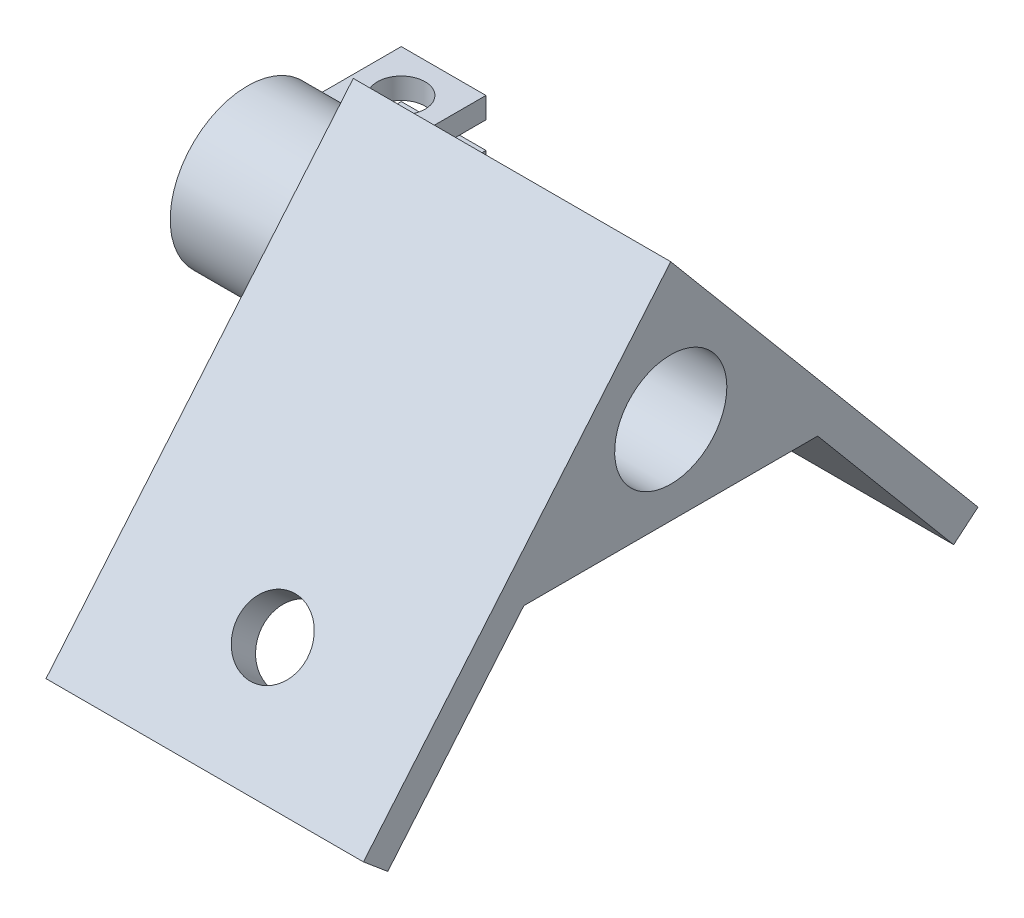
ISO-10303-21;
HEADER;
FILE_DESCRIPTION(('STEP AP214'),'2;1');
FILE_NAME('part.step','',(''),(''),'','','');
FILE_SCHEMA(('AUTOMOTIVE_DESIGN { 1 0 10303 214 1 1 1 1 }'));
ENDSEC;
DATA;
#1=APPLICATION_CONTEXT('core data for automotive mechanical design processes');
#2=APPLICATION_PROTOCOL_DEFINITION('international standard','automotive_design',2000,#1);
#3=PRODUCT_CONTEXT('',#1,'mechanical');
#4=PRODUCT('Part','Part','',(#3));
#5=PRODUCT_RELATED_PRODUCT_CATEGORY('part','',(#4));
#6=PRODUCT_DEFINITION_FORMATION('','',#4);
#7=PRODUCT_DEFINITION_CONTEXT('part definition',#1,'design');
#8=PRODUCT_DEFINITION('design','',#6,#7);
#9=PRODUCT_DEFINITION_SHAPE('','',#8);
#10=(LENGTH_UNIT() NAMED_UNIT(*) SI_UNIT(.MILLI.,.METRE.));
#11=(NAMED_UNIT(*) PLANE_ANGLE_UNIT() SI_UNIT($,.RADIAN.));
#12=(NAMED_UNIT(*) SI_UNIT($,.STERADIAN.) SOLID_ANGLE_UNIT());
#13=UNCERTAINTY_MEASURE_WITH_UNIT(LENGTH_MEASURE(1.E-05),#10,'distance_accuracy_value','');
#14=(GEOMETRIC_REPRESENTATION_CONTEXT(3) GLOBAL_UNCERTAINTY_ASSIGNED_CONTEXT((#13)) GLOBAL_UNIT_ASSIGNED_CONTEXT((#10,
#11,#12)) REPRESENTATION_CONTEXT('',''));
#15=CARTESIAN_POINT('',(0.,0.,0.));
#16=DIRECTION('',(0.,0.,1.));
#17=DIRECTION('',(1.,0.,0.));
#18=AXIS2_PLACEMENT_3D('',#15,#16,#17);
#19=CARTESIAN_POINT('',(15.,0.,0.));
#20=DIRECTION('',(-1.,0.,0.));
#21=DIRECTION('',(0.,0.,1.));
#22=AXIS2_PLACEMENT_3D('',#19,#20,#21);
#23=PLANE('',#22);
#24=DIRECTION('',(0.,0.766044443118977,0.64278760968654));
#25=VECTOR('',#24,1.);
#26=CARTESIAN_POINT('',(15.,12.9125077629414,0.));
#27=LINE('',#26,#25);
#28=CARTESIAN_POINT('',(15.,-21.6925260333199,-29.0370710953203));
#29=VERTEX_POINT('',#28);
#30=CARTESIAN_POINT('',(15.,12.9125077629414,0.));
#31=VERTEX_POINT('',#30);
#32=EDGE_CURVE('E253',#29,#31,#27,.T.);
#33=ORIENTED_EDGE('',*,*,#32,.T.);
#34=DIRECTION('',(0.,-0.766044443118977,0.642787609686541));
#35=VECTOR('',#34,1.);
#36=CARTESIAN_POINT('',(15.,12.9125077629414,0.));
#37=LINE('',#36,#35);
#38=CARTESIAN_POINT('',(15.,-21.6925260333199,29.0370710953203));
#39=VERTEX_POINT('',#38);
#40=EDGE_CURVE('E256',#31,#39,#37,.T.);
#41=ORIENTED_EDGE('',*,*,#40,.T.);
#42=DIRECTION('',(0.,-0.642787609686539,-0.766044443118978));
#43=VECTOR('',#42,1.);
#44=CARTESIAN_POINT('',(15.,-21.6925260333199,29.0370710953203));
#45=LINE('',#44,#43);
#46=CARTESIAN_POINT('',(15.,-23.6208888623795,26.7389377659634));
#47=VERTEX_POINT('',#46);
#48=EDGE_CURVE('E259',#39,#47,#45,.T.);
#49=ORIENTED_EDGE('',*,*,#48,.T.);
#50=DIRECTION('',(0.,0.766044443118977,-0.642787609686541));
#51=VECTOR('',#50,1.);
#52=CARTESIAN_POINT('',(15.,-23.6208888623795,26.7389377659634));
#53=LINE('',#52,#51);
#54=CARTESIAN_POINT('',(15.,-8.3,13.8831855722325));
#55=VERTEX_POINT('',#54);
#56=EDGE_CURVE('E261',#47,#55,#53,.T.);
#57=ORIENTED_EDGE('',*,*,#56,.T.);
#58=DIRECTION('',(0.,0.,-1.));
#59=VECTOR('',#58,1.);
#60=CARTESIAN_POINT('',(15.,-8.3,13.8831855722325));
#61=LINE('',#60,#59);
#62=CARTESIAN_POINT('',(15.,-8.3,-13.8831855722325));
#63=VERTEX_POINT('',#62);
#64=EDGE_CURVE('E263',#55,#63,#61,.T.);
#65=ORIENTED_EDGE('',*,*,#64,.T.);
#66=DIRECTION('',(0.,-0.766044443118977,-0.64278760968654));
#67=VECTOR('',#66,1.);
#68=CARTESIAN_POINT('',(15.,-23.6208888623795,-26.7389377659633));
#69=LINE('',#68,#67);
#70=CARTESIAN_POINT('',(15.,-23.6208888623795,-26.7389377659633));
#71=VERTEX_POINT('',#70);
#72=EDGE_CURVE('E265',#63,#71,#69,.T.);
#73=ORIENTED_EDGE('',*,*,#72,.T.);
#74=DIRECTION('',(0.,0.642787609686539,-0.766044443118978));
#75=VECTOR('',#74,1.);
#76=CARTESIAN_POINT('',(15.,-21.6925260333199,-29.0370710953203));
#77=LINE('',#76,#75);
#78=EDGE_CURVE('E267',#71,#29,#77,.T.);
#79=ORIENTED_EDGE('',*,*,#78,.T.);
#80=EDGE_LOOP('',(#33,#41,#49,#57,#65,#73,#79));
#81=FACE_BOUND('',#80,.T.);
#82=CARTESIAN_POINT('',(15.,0.,0.));
#83=DIRECTION('',(1.,0.,0.));
#84=DIRECTION('',(0.,0.,-1.));
#85=AXIS2_PLACEMENT_3D('',#82,#83,#84);
#86=CIRCLE('',#85,5.3);
#87=CARTESIAN_POINT('',(15.,0.,-5.3));
#88=VERTEX_POINT('',#87);
#89=EDGE_CURVE('E249',#88,#88,#86,.T.);
#90=ORIENTED_EDGE('',*,*,#89,.F.);
#91=EDGE_LOOP('',(#90));
#92=FACE_BOUND('',#91,.T.);
#93=ADVANCED_FACE('F35',(#81,#92),#23,.F.);
#94=CARTESIAN_POINT('',(-15.,0.,0.));
#95=DIRECTION('',(-1.,0.,0.));
#96=DIRECTION('',(0.,0.,1.));
#97=AXIS2_PLACEMENT_3D('',#94,#95,#96);
#98=PLANE('',#97);
#99=DIRECTION('',(0.,0.,1.));
#100=VECTOR('',#99,1.);
#101=CARTESIAN_POINT('',(-15.,1.25,-5.15048541401682));
#102=LINE('',#101,#100);
#103=CARTESIAN_POINT('',(-15.,1.25,-7.19218325684211));
#104=VERTEX_POINT('',#103);
#105=CARTESIAN_POINT('',(-15.,1.25,-5.15048541401682));
#106=VERTEX_POINT('',#105);
#107=EDGE_CURVE('E236',#104,#106,#102,.T.);
#108=ORIENTED_EDGE('',*,*,#107,.F.);
#109=CARTESIAN_POINT('',(-15.,0.,0.));
#110=DIRECTION('',(-1.,0.,0.));
#111=DIRECTION('',(0.,0.,1.));
#112=AXIS2_PLACEMENT_3D('',#109,#110,#111);
#113=CIRCLE('',#112,7.3);
#114=CARTESIAN_POINT('',(-15.,-1.25,-7.19218325684211));
#115=VERTEX_POINT('',#114);
#116=EDGE_CURVE('E224',#115,#104,#113,.T.);
#117=ORIENTED_EDGE('',*,*,#116,.F.);
#118=DIRECTION('',(0.,0.,-1.));
#119=VECTOR('',#118,1.);
#120=CARTESIAN_POINT('',(-15.,-1.25,-5.15048541401682));
#121=LINE('',#120,#119);
#122=CARTESIAN_POINT('',(-15.,-1.25,-5.15048541401682));
#123=VERTEX_POINT('',#122);
#124=EDGE_CURVE('E306',#123,#115,#121,.T.);
#125=ORIENTED_EDGE('',*,*,#124,.F.);
#126=CARTESIAN_POINT('',(-15.,0.,0.));
#127=DIRECTION('',(1.,0.,0.));
#128=DIRECTION('',(0.,0.,-1.));
#129=AXIS2_PLACEMENT_3D('',#126,#127,#128);
#130=CIRCLE('',#129,5.3);
#131=EDGE_CURVE('E172',#123,#106,#130,.T.);
#132=ORIENTED_EDGE('',*,*,#131,.T.);
#133=EDGE_LOOP('',(#108,#117,#125,#132));
#134=FACE_BOUND('',#133,.T.);
#135=DIRECTION('',(0.,0.766044443118977,0.64278760968654));
#136=VECTOR('',#135,1.);
#137=CARTESIAN_POINT('',(-15.,12.9125077629414,0.));
#138=LINE('',#137,#136);
#139=CARTESIAN_POINT('',(-15.,-21.6925260333199,-29.0370710953203));
#140=VERTEX_POINT('',#139);
#141=CARTESIAN_POINT('',(-15.,12.9125077629414,0.));
#142=VERTEX_POINT('',#141);
#143=EDGE_CURVE('E252',#140,#142,#138,.T.);
#144=ORIENTED_EDGE('',*,*,#143,.F.);
#145=DIRECTION('',(0.,0.642787609686539,-0.766044443118978));
#146=VECTOR('',#145,1.);
#147=CARTESIAN_POINT('',(-15.,-21.6925260333199,-29.0370710953203));
#148=LINE('',#147,#146);
#149=CARTESIAN_POINT('',(-15.,-23.6208888623795,-26.7389377659633));
#150=VERTEX_POINT('',#149);
#151=EDGE_CURVE('E257',#150,#140,#148,.T.);
#152=ORIENTED_EDGE('',*,*,#151,.F.);
#153=DIRECTION('',(0.,-0.766044443118977,-0.64278760968654));
#154=VECTOR('',#153,1.);
#155=CARTESIAN_POINT('',(-15.,-23.6208888623795,-26.7389377659633));
#156=LINE('',#155,#154);
#157=CARTESIAN_POINT('',(-15.,-8.3,-13.8831855722325));
#158=VERTEX_POINT('',#157);
#159=EDGE_CURVE('E280',#158,#150,#156,.T.);
#160=ORIENTED_EDGE('',*,*,#159,.F.);
#161=DIRECTION('',(0.,0.,-1.));
#162=VECTOR('',#161,1.);
#163=CARTESIAN_POINT('',(-15.,-8.3,13.8831855722325));
#164=LINE('',#163,#162);
#165=CARTESIAN_POINT('',(-15.,-8.3,13.8831855722325));
#166=VERTEX_POINT('',#165);
#167=EDGE_CURVE('E278',#166,#158,#164,.T.);
#168=ORIENTED_EDGE('',*,*,#167,.F.);
#169=DIRECTION('',(0.,0.766044443118977,-0.642787609686541));
#170=VECTOR('',#169,1.);
#171=CARTESIAN_POINT('',(-15.,-23.6208888623795,26.7389377659634));
#172=LINE('',#171,#170);
#173=CARTESIAN_POINT('',(-15.,-23.6208888623795,26.7389377659634));
#174=VERTEX_POINT('',#173);
#175=EDGE_CURVE('E276',#174,#166,#172,.T.);
#176=ORIENTED_EDGE('',*,*,#175,.F.);
#177=DIRECTION('',(0.,-0.642787609686539,-0.766044443118978));
#178=VECTOR('',#177,1.);
#179=CARTESIAN_POINT('',(-15.,-21.6925260333199,29.0370710953203));
#180=LINE('',#179,#178);
#181=CARTESIAN_POINT('',(-15.,-21.6925260333199,29.0370710953203));
#182=VERTEX_POINT('',#181);
#183=EDGE_CURVE('E274',#182,#174,#180,.T.);
#184=ORIENTED_EDGE('',*,*,#183,.F.);
#185=DIRECTION('',(0.,-0.766044443118977,0.642787609686541));
#186=VECTOR('',#185,1.);
#187=CARTESIAN_POINT('',(-15.,12.9125077629414,0.));
#188=LINE('',#187,#186);
#189=EDGE_CURVE('E272',#142,#182,#188,.T.);
#190=ORIENTED_EDGE('',*,*,#189,.F.);
#191=EDGE_LOOP('',(#144,#152,#160,#168,#176,#184,#190));
#192=FACE_BOUND('',#191,.T.);
#193=ADVANCED_FACE('F377',(#134,#192),#98,.T.);
#194=CARTESIAN_POINT('',(15.,12.9125077629414,0.));
#195=DIRECTION('',(0.,-0.64278760968654,0.766044443118977));
#196=DIRECTION('',(0.,-0.766044443118977,-0.64278760968654));
#197=AXIS2_PLACEMENT_3D('',#194,#195,#196);
#198=PLANE('',#197);
#199=CARTESIAN_POINT('',(0.,-14.0320816021302,-22.6091949984549));
#200=DIRECTION('',(0.,-0.64278760968654,0.766044443118977));
#201=DIRECTION('',(0.,-0.766044443118977,-0.64278760968654));
#202=AXIS2_PLACEMENT_3D('',#199,#200,#201);
#203=CIRCLE('',#202,3.29999999999999);
#204=CARTESIAN_POINT('',(0.,-16.5600282644228,-24.7303941104204));
#205=VERTEX_POINT('',#204);
#206=EDGE_CURVE('E244',#205,#205,#203,.T.);
#207=ORIENTED_EDGE('',*,*,#206,.T.);
#208=EDGE_LOOP('',(#207));
#209=FACE_BOUND('',#208,.T.);
#210=ORIENTED_EDGE('',*,*,#143,.T.);
#211=DIRECTION('',(-1.,0.,0.));
#212=VECTOR('',#211,1.);
#213=CARTESIAN_POINT('',(15.,12.9125077629414,0.));
#214=LINE('',#213,#212);
#215=EDGE_CURVE('E11',#31,#142,#214,.T.);
#216=ORIENTED_EDGE('',*,*,#215,.F.);
#217=ORIENTED_EDGE('',*,*,#32,.F.);
#218=DIRECTION('',(-1.,0.,0.));
#219=VECTOR('',#218,1.);
#220=CARTESIAN_POINT('',(15.,-21.6925260333199,-29.0370710953203));
#221=LINE('',#220,#219);
#222=EDGE_CURVE('E269',#29,#140,#221,.T.);
#223=ORIENTED_EDGE('',*,*,#222,.T.);
#224=EDGE_LOOP('',(#210,#216,#217,#223));
#225=FACE_BOUND('',#224,.T.);
#226=ADVANCED_FACE('F37',(#209,#225),#198,.F.);
#227=CARTESIAN_POINT('',(15.,12.9125077629414,0.));
#228=DIRECTION('',(0.,-0.642787609686541,-0.766044443118977));
#229=DIRECTION('',(0.,0.766044443118977,-0.642787609686541));
#230=AXIS2_PLACEMENT_3D('',#227,#228,#229);
#231=PLANE('',#230);
#232=CARTESIAN_POINT('',(0.,-14.0320816021302,22.6091949984549));
#233=DIRECTION('',(0.,-0.642787609686541,-0.766044443118977));
#234=DIRECTION('',(0.,0.766044443118977,-0.642787609686541));
#235=AXIS2_PLACEMENT_3D('',#232,#233,#234);
#236=CIRCLE('',#235,3.29999999999999);
#237=CARTESIAN_POINT('',(0.,-11.5041349398375,20.4879958864893));
#238=VERTEX_POINT('',#237);
#239=EDGE_CURVE('E248',#238,#238,#236,.T.);
#240=ORIENTED_EDGE('',*,*,#239,.T.);
#241=EDGE_LOOP('',(#240));
#242=FACE_BOUND('',#241,.T.);
#243=ORIENTED_EDGE('',*,*,#189,.T.);
#244=DIRECTION('',(-1.,0.,0.));
#245=VECTOR('',#244,1.);
#246=CARTESIAN_POINT('',(15.,-21.6925260333199,29.0370710953203));
#247=LINE('',#246,#245);
#248=EDGE_CURVE('E44',#39,#182,#247,.T.);
#249=ORIENTED_EDGE('',*,*,#248,.F.);
#250=ORIENTED_EDGE('',*,*,#40,.F.);
#251=ORIENTED_EDGE('',*,*,#215,.T.);
#252=EDGE_LOOP('',(#243,#249,#250,#251));
#253=FACE_BOUND('',#252,.T.);
#254=ADVANCED_FACE('F412',(#242,#253),#231,.F.);
#255=CARTESIAN_POINT('',(15.,-21.6925260333199,29.0370710953203));
#256=DIRECTION('',(0.,0.766044443118978,-0.642787609686539));
#257=DIRECTION('',(0.,0.642787609686539,0.766044443118978));
#258=AXIS2_PLACEMENT_3D('',#255,#256,#257);
#259=PLANE('',#258);
#260=ORIENTED_EDGE('',*,*,#183,.T.);
#261=DIRECTION('',(-1.,0.,0.));
#262=VECTOR('',#261,1.);
#263=CARTESIAN_POINT('',(15.,-23.6208888623795,26.7389377659634));
#264=LINE('',#263,#262);
#265=EDGE_CURVE('E294',#47,#174,#264,.T.);
#266=ORIENTED_EDGE('',*,*,#265,.F.);
#267=ORIENTED_EDGE('',*,*,#48,.F.);
#268=ORIENTED_EDGE('',*,*,#248,.T.);
#269=EDGE_LOOP('',(#260,#266,#267,#268));
#270=FACE_BOUND('',#269,.T.);
#271=ADVANCED_FACE('F409',(#270),#259,.F.);
#272=CARTESIAN_POINT('',(15.,-23.6208888623795,26.7389377659634));
#273=DIRECTION('',(0.,0.642787609686541,0.766044443118977));
#274=DIRECTION('',(0.,-0.766044443118977,0.642787609686541));
#275=AXIS2_PLACEMENT_3D('',#272,#273,#274);
#276=PLANE('',#275);
#277=CARTESIAN_POINT('',(0.,-15.9604444311898,20.311061669098));
#278=DIRECTION('',(0.,-0.642787609686541,-0.766044443118977));
#279=DIRECTION('',(0.,0.766044443118977,-0.642787609686541));
#280=AXIS2_PLACEMENT_3D('',#277,#278,#279);
#281=CIRCLE('',#280,3.29999999999999);
#282=CARTESIAN_POINT('',(0.,-13.4324977688972,18.1898625571324));
#283=VERTEX_POINT('',#282);
#284=EDGE_CURVE('E245',#283,#283,#281,.T.);
#285=ORIENTED_EDGE('',*,*,#284,.F.);
#286=EDGE_LOOP('',(#285));
#287=FACE_BOUND('',#286,.T.);
#288=ORIENTED_EDGE('',*,*,#175,.T.);
#289=DIRECTION('',(-1.,0.,0.));
#290=VECTOR('',#289,1.);
#291=CARTESIAN_POINT('',(15.,-8.3,13.8831855722325));
#292=LINE('',#291,#290);
#293=EDGE_CURVE('E291',#55,#166,#292,.T.);
#294=ORIENTED_EDGE('',*,*,#293,.F.);
#295=ORIENTED_EDGE('',*,*,#56,.F.);
#296=ORIENTED_EDGE('',*,*,#265,.T.);
#297=EDGE_LOOP('',(#288,#294,#295,#296));
#298=FACE_BOUND('',#297,.T.);
#299=ADVANCED_FACE('F405',(#287,#298),#276,.F.);
#300=CARTESIAN_POINT('',(15.,-8.3,13.8831855722325));
#301=DIRECTION('',(0.,1.,0.));
#302=DIRECTION('',(0.,0.,1.));
#303=AXIS2_PLACEMENT_3D('',#300,#301,#302);
#304=PLANE('',#303);
#305=ORIENTED_EDGE('',*,*,#167,.T.);
#306=DIRECTION('',(-1.,0.,0.));
#307=VECTOR('',#306,1.);
#308=CARTESIAN_POINT('',(15.,-8.3,-13.8831855722325));
#309=LINE('',#308,#307);
#310=EDGE_CURVE('E288',#63,#158,#309,.T.);
#311=ORIENTED_EDGE('',*,*,#310,.F.);
#312=ORIENTED_EDGE('',*,*,#64,.F.);
#313=ORIENTED_EDGE('',*,*,#293,.T.);
#314=EDGE_LOOP('',(#305,#311,#312,#313));
#315=FACE_BOUND('',#314,.T.);
#316=ADVANCED_FACE('F400',(#315),#304,.F.);
#317=CARTESIAN_POINT('',(15.,-23.6208888623795,-26.7389377659633));
#318=DIRECTION('',(0.,0.64278760968654,-0.766044443118977));
#319=DIRECTION('',(0.,0.766044443118977,0.64278760968654));
#320=AXIS2_PLACEMENT_3D('',#317,#318,#319);
#321=PLANE('',#320);
#322=CARTESIAN_POINT('',(0.,-15.9604444311898,-20.311061669098));
#323=DIRECTION('',(0.,-0.642787609686541,0.766044443118977));
#324=DIRECTION('',(0.,-0.766044443118977,-0.642787609686541));
#325=AXIS2_PLACEMENT_3D('',#322,#323,#324);
#326=CIRCLE('',#325,3.29999999999999);
#327=CARTESIAN_POINT('',(0.,-18.4883910934824,-22.4322607810635));
#328=VERTEX_POINT('',#327);
#329=EDGE_CURVE('E175',#328,#328,#326,.T.);
#330=ORIENTED_EDGE('',*,*,#329,.F.);
#331=EDGE_LOOP('',(#330));
#332=FACE_BOUND('',#331,.T.);
#333=ORIENTED_EDGE('',*,*,#159,.T.);
#334=DIRECTION('',(-1.,0.,0.));
#335=VECTOR('',#334,1.);
#336=CARTESIAN_POINT('',(15.,-23.6208888623795,-26.7389377659633));
#337=LINE('',#336,#335);
#338=EDGE_CURVE('E285',#71,#150,#337,.T.);
#339=ORIENTED_EDGE('',*,*,#338,.F.);
#340=ORIENTED_EDGE('',*,*,#72,.F.);
#341=ORIENTED_EDGE('',*,*,#310,.T.);
#342=EDGE_LOOP('',(#333,#339,#340,#341));
#343=FACE_BOUND('',#342,.T.);
#344=ADVANCED_FACE('F395',(#332,#343),#321,.F.);
#345=CARTESIAN_POINT('',(15.,-21.6925260333199,-29.0370710953203));
#346=DIRECTION('',(0.,0.766044443118978,0.642787609686539));
#347=DIRECTION('',(0.,-0.642787609686539,0.766044443118978));
#348=AXIS2_PLACEMENT_3D('',#345,#346,#347);
#349=PLANE('',#348);
#350=ORIENTED_EDGE('',*,*,#151,.T.);
#351=ORIENTED_EDGE('',*,*,#222,.F.);
#352=ORIENTED_EDGE('',*,*,#78,.F.);
#353=ORIENTED_EDGE('',*,*,#338,.T.);
#354=EDGE_LOOP('',(#350,#351,#352,#353));
#355=FACE_BOUND('',#354,.T.);
#356=ADVANCED_FACE('F391',(#355),#349,.F.);
#357=CARTESIAN_POINT('',(15.,0.,0.));
#358=DIRECTION('',(-1.,0.,0.));
#359=DIRECTION('',(0.,0.,1.));
#360=AXIS2_PLACEMENT_3D('',#357,#358,#359);
#361=CYLINDRICAL_SURFACE('',#360,5.3);
#362=ORIENTED_EDGE('',*,*,#89,.T.);
#363=EDGE_LOOP('',(#362));
#364=FACE_BOUND('',#363,.T.);
#365=ORIENTED_EDGE('',*,*,#131,.F.);
#366=DIRECTION('',(1.,0.,0.));
#367=VECTOR('',#366,1.);
#368=CARTESIAN_POINT('',(-17.,-1.25,-5.15048541401682));
#369=LINE('',#368,#367);
#370=CARTESIAN_POINT('',(-25.,-1.25,-5.15048541401682));
#371=VERTEX_POINT('',#370);
#372=EDGE_CURVE('E166',#371,#123,#369,.T.);
#373=ORIENTED_EDGE('',*,*,#372,.F.);
#374=CARTESIAN_POINT('',(-25.,0.,0.));
#375=DIRECTION('',(1.,0.,0.));
#376=DIRECTION('',(0.,0.,-1.));
#377=AXIS2_PLACEMENT_3D('',#374,#375,#376);
#378=CIRCLE('',#377,5.3);
#379=CARTESIAN_POINT('',(-25.,1.25,-5.15048541401682));
#380=VERTEX_POINT('',#379);
#381=EDGE_CURVE('E171',#380,#371,#378,.T.);
#382=ORIENTED_EDGE('',*,*,#381,.F.);
#383=DIRECTION('',(1.,0.,0.));
#384=VECTOR('',#383,1.);
#385=CARTESIAN_POINT('',(-17.,1.25,-5.15048541401682));
#386=LINE('',#385,#384);
#387=EDGE_CURVE('E231',#380,#106,#386,.T.);
#388=ORIENTED_EDGE('',*,*,#387,.T.);
#389=EDGE_LOOP('',(#365,#373,#382,#388));
#390=FACE_BOUND('',#389,.T.);
#391=ADVANCED_FACE('F168',(#364,#390),#361,.F.);
#392=CARTESIAN_POINT('',(0.,-15.9604444311898,20.311061669098));
#393=DIRECTION('',(0.,-0.642787609686541,-0.766044443118977));
#394=DIRECTION('',(0.,0.766044443118977,-0.642787609686541));
#395=AXIS2_PLACEMENT_3D('',#392,#393,#394);
#396=CYLINDRICAL_SURFACE('',#395,3.29999999999999);
#397=ORIENTED_EDGE('',*,*,#284,.T.);
#398=EDGE_LOOP('',(#397));
#399=FACE_BOUND('',#398,.T.);
#400=ORIENTED_EDGE('',*,*,#239,.F.);
#401=EDGE_LOOP('',(#400));
#402=FACE_BOUND('',#401,.T.);
#403=ADVANCED_FACE('F420',(#399,#402),#396,.F.);
#404=CARTESIAN_POINT('',(0.,-15.9604444311898,-20.311061669098));
#405=DIRECTION('',(0.,-0.642787609686541,0.766044443118977));
#406=DIRECTION('',(0.,-0.766044443118977,-0.642787609686541));
#407=AXIS2_PLACEMENT_3D('',#404,#405,#406);
#408=CYLINDRICAL_SURFACE('',#407,3.29999999999999);
#409=ORIENTED_EDGE('',*,*,#329,.T.);
#410=EDGE_LOOP('',(#409));
#411=FACE_BOUND('',#410,.T.);
#412=ORIENTED_EDGE('',*,*,#206,.F.);
#413=EDGE_LOOP('',(#412));
#414=FACE_BOUND('',#413,.T.);
#415=ADVANCED_FACE('F426',(#411,#414),#408,.F.);
#416=CARTESIAN_POINT('',(-17.,-1.25,-5.15048541401682));
#417=DIRECTION('',(0.,-1.,0.));
#418=DIRECTION('',(0.,0.,-1.));
#419=AXIS2_PLACEMENT_3D('',#416,#417,#418);
#420=PLANE('',#419);
#421=CARTESIAN_POINT('',(-21.,-1.25,-10.5366275708503));
#422=DIRECTION('',(0.,-1.,0.));
#423=DIRECTION('',(0.,0.,-1.));
#424=AXIS2_PLACEMENT_3D('',#421,#422,#423);
#425=CIRCLE('',#424,2.25);
#426=CARTESIAN_POINT('',(-21.,-1.25,-12.7866275708503));
#427=VERTEX_POINT('',#426);
#428=EDGE_CURVE('E197',#427,#427,#425,.T.);
#429=ORIENTED_EDGE('',*,*,#428,.T.);
#430=EDGE_LOOP('',(#429));
#431=FACE_BOUND('',#430,.T.);
#432=ORIENTED_EDGE('',*,*,#124,.T.);
#433=DIRECTION('',(1.,0.,0.));
#434=VECTOR('',#433,1.);
#435=CARTESIAN_POINT('',(-17.,-1.25,-7.19218325684211));
#436=LINE('',#435,#434);
#437=CARTESIAN_POINT('',(-17.,-1.25,-7.19218325684211));
#438=VERTEX_POINT('',#437);
#439=EDGE_CURVE('E176',#438,#115,#436,.T.);
#440=ORIENTED_EDGE('',*,*,#439,.F.);
#441=DIRECTION('',(0.,0.,-1.));
#442=VECTOR('',#441,1.);
#443=CARTESIAN_POINT('',(-17.,-1.25,-5.15048541401682));
#444=LINE('',#443,#442);
#445=CARTESIAN_POINT('',(-17.,-1.25,-14.5366275708503));
#446=VERTEX_POINT('',#445);
#447=EDGE_CURVE('E218',#438,#446,#444,.T.);
#448=ORIENTED_EDGE('',*,*,#447,.T.);
#449=DIRECTION('',(1.,0.,0.));
#450=VECTOR('',#449,1.);
#451=CARTESIAN_POINT('',(-25.,-1.25,-14.5366275708503));
#452=LINE('',#451,#450);
#453=CARTESIAN_POINT('',(-25.,-1.25,-14.5366275708503));
#454=VERTEX_POINT('',#453);
#455=EDGE_CURVE('E182',#454,#446,#452,.T.);
#456=ORIENTED_EDGE('',*,*,#455,.F.);
#457=DIRECTION('',(0.,0.,-1.));
#458=VECTOR('',#457,1.);
#459=CARTESIAN_POINT('',(-25.,-1.25,-5.15048541401682));
#460=LINE('',#459,#458);
#461=EDGE_CURVE('E179',#371,#454,#460,.T.);
#462=ORIENTED_EDGE('',*,*,#461,.F.);
#463=ORIENTED_EDGE('',*,*,#372,.T.);
#464=EDGE_LOOP('',(#432,#440,#448,#456,#462,#463));
#465=FACE_BOUND('',#464,.T.);
#466=ADVANCED_FACE('F180',(#431,#465),#420,.F.);
#467=CARTESIAN_POINT('',(-17.,0.,0.));
#468=DIRECTION('',(1.,0.,0.));
#469=DIRECTION('',(0.,0.,-1.));
#470=AXIS2_PLACEMENT_3D('',#467,#468,#469);
#471=CYLINDRICAL_SURFACE('',#470,7.3);
#472=ORIENTED_EDGE('',*,*,#116,.T.);
#473=DIRECTION('',(1.,0.,0.));
#474=VECTOR('',#473,1.);
#475=CARTESIAN_POINT('',(-17.,1.25,-7.19218325684211));
#476=LINE('',#475,#474);
#477=CARTESIAN_POINT('',(-17.,1.25,-7.19218325684211));
#478=VERTEX_POINT('',#477);
#479=EDGE_CURVE('E235',#478,#104,#476,.T.);
#480=ORIENTED_EDGE('',*,*,#479,.F.);
#481=CARTESIAN_POINT('',(-17.,0.,0.));
#482=DIRECTION('',(-1.,0.,0.));
#483=DIRECTION('',(0.,0.,1.));
#484=AXIS2_PLACEMENT_3D('',#481,#482,#483);
#485=CIRCLE('',#484,7.3);
#486=CARTESIAN_POINT('',(-17.,3.25,-6.53662757085028));
#487=VERTEX_POINT('',#486);
#488=EDGE_CURVE('E52',#487,#478,#485,.T.);
#489=ORIENTED_EDGE('',*,*,#488,.F.);
#490=DIRECTION('',(1.,0.,0.));
#491=VECTOR('',#490,1.);
#492=CARTESIAN_POINT('',(-25.,3.25,-6.53662757085028));
#493=LINE('',#492,#491);
#494=CARTESIAN_POINT('',(-25.,3.25,-6.53662757085028));
#495=VERTEX_POINT('',#494);
#496=EDGE_CURVE('E324',#495,#487,#493,.T.);
#497=ORIENTED_EDGE('',*,*,#496,.F.);
#498=CARTESIAN_POINT('',(-25.,0.,0.));
#499=DIRECTION('',(-1.,0.,0.));
#500=DIRECTION('',(0.,0.,-1.));
#501=AXIS2_PLACEMENT_3D('',#498,#499,#500);
#502=CIRCLE('',#501,7.3);
#503=CARTESIAN_POINT('',(-25.,-3.25,-6.53662757085028));
#504=VERTEX_POINT('',#503);
#505=EDGE_CURVE('E205',#504,#495,#502,.T.);
#506=ORIENTED_EDGE('',*,*,#505,.F.);
#507=DIRECTION('',(1.,0.,0.));
#508=VECTOR('',#507,1.);
#509=CARTESIAN_POINT('',(-25.,-3.25,-6.53662757085028));
#510=LINE('',#509,#508);
#511=CARTESIAN_POINT('',(-17.,-3.25,-6.53662757085028));
#512=VERTEX_POINT('',#511);
#513=EDGE_CURVE('E320',#504,#512,#510,.T.);
#514=ORIENTED_EDGE('',*,*,#513,.T.);
#515=EDGE_CURVE('E60',#438,#512,#485,.T.);
#516=ORIENTED_EDGE('',*,*,#515,.F.);
#517=ORIENTED_EDGE('',*,*,#439,.T.);
#518=EDGE_LOOP('',(#472,#480,#489,#497,#506,#514,#516,#517));
#519=FACE_BOUND('',#518,.T.);
#520=ADVANCED_FACE('F346',(#519),#471,.T.);
#521=CARTESIAN_POINT('',(-17.,1.25,-5.15048541401682));
#522=DIRECTION('',(0.,1.,0.));
#523=DIRECTION('',(0.,0.,1.));
#524=AXIS2_PLACEMENT_3D('',#521,#522,#523);
#525=PLANE('',#524);
#526=CARTESIAN_POINT('',(-21.,1.25,-10.5366275708503));
#527=DIRECTION('',(0.,1.,0.));
#528=DIRECTION('',(0.,0.,1.));
#529=AXIS2_PLACEMENT_3D('',#526,#527,#528);
#530=CIRCLE('',#529,2.25);
#531=CARTESIAN_POINT('',(-21.,1.25,-8.28662757085028));
#532=VERTEX_POINT('',#531);
#533=EDGE_CURVE('E496',#532,#532,#530,.T.);
#534=ORIENTED_EDGE('',*,*,#533,.T.);
#535=EDGE_LOOP('',(#534));
#536=FACE_BOUND('',#535,.T.);
#537=ORIENTED_EDGE('',*,*,#107,.T.);
#538=ORIENTED_EDGE('',*,*,#387,.F.);
#539=DIRECTION('',(0.,0.,1.));
#540=VECTOR('',#539,1.);
#541=CARTESIAN_POINT('',(-25.,1.25,-5.15048541401682));
#542=LINE('',#541,#540);
#543=CARTESIAN_POINT('',(-25.,1.25,-14.5366275708503));
#544=VERTEX_POINT('',#543);
#545=EDGE_CURVE('E190',#544,#380,#542,.T.);
#546=ORIENTED_EDGE('',*,*,#545,.F.);
#547=DIRECTION('',(1.,0.,0.));
#548=VECTOR('',#547,1.);
#549=CARTESIAN_POINT('',(-25.,1.25,-14.5366275708503));
#550=LINE('',#549,#548);
#551=CARTESIAN_POINT('',(-17.,1.25,-14.5366275708503));
#552=VERTEX_POINT('',#551);
#553=EDGE_CURVE('E212',#544,#552,#550,.T.);
#554=ORIENTED_EDGE('',*,*,#553,.T.);
#555=DIRECTION('',(0.,0.,1.));
#556=VECTOR('',#555,1.);
#557=CARTESIAN_POINT('',(-17.,1.25,-5.15048541401682));
#558=LINE('',#557,#556);
#559=EDGE_CURVE('E191',#552,#478,#558,.T.);
#560=ORIENTED_EDGE('',*,*,#559,.T.);
#561=ORIENTED_EDGE('',*,*,#479,.T.);
#562=EDGE_LOOP('',(#537,#538,#546,#554,#560,#561));
#563=FACE_BOUND('',#562,.T.);
#564=ADVANCED_FACE('F375',(#536,#563),#525,.F.);
#565=CARTESIAN_POINT('',(-17.,0.,0.));
#566=DIRECTION('',(1.,0.,0.));
#567=DIRECTION('',(0.,0.,-1.));
#568=AXIS2_PLACEMENT_3D('',#565,#566,#567);
#569=PLANE('',#568);
#570=ORIENTED_EDGE('',*,*,#447,.F.);
#571=ORIENTED_EDGE('',*,*,#515,.T.);
#572=DIRECTION('',(0.,1.,0.));
#573=VECTOR('',#572,1.);
#574=CARTESIAN_POINT('',(-17.,-3.25,-6.53662757085028));
#575=LINE('',#574,#573);
#576=CARTESIAN_POINT('',(-17.,-10.25,-6.53662757085028));
#577=VERTEX_POINT('',#576);
#578=EDGE_CURVE('E330',#577,#512,#575,.T.);
#579=ORIENTED_EDGE('',*,*,#578,.F.);
#580=DIRECTION('',(0.,0.,1.));
#581=VECTOR('',#580,1.);
#582=CARTESIAN_POINT('',(-17.,-10.25,-6.53662757085028));
#583=LINE('',#582,#581);
#584=CARTESIAN_POINT('',(-17.,-10.25,-14.5366275708503));
#585=VERTEX_POINT('',#584);
#586=EDGE_CURVE('E329',#585,#577,#583,.T.);
#587=ORIENTED_EDGE('',*,*,#586,.F.);
#588=DIRECTION('',(0.,-1.,0.));
#589=VECTOR('',#588,1.);
#590=CARTESIAN_POINT('',(-17.,-1.25,-14.5366275708503));
#591=LINE('',#590,#589);
#592=EDGE_CURVE('E215',#446,#585,#591,.T.);
#593=ORIENTED_EDGE('',*,*,#592,.F.);
#594=EDGE_LOOP('',(#570,#571,#579,#587,#593));
#595=FACE_BOUND('',#594,.T.);
#596=ADVANCED_FACE('F339',(#595),#569,.T.);
#597=CARTESIAN_POINT('',(-25.,-1.25,-14.5366275708503));
#598=DIRECTION('',(0.,0.,1.));
#599=DIRECTION('',(1.,0.,0.));
#600=AXIS2_PLACEMENT_3D('',#597,#598,#599);
#601=PLANE('',#600);
#602=ORIENTED_EDGE('',*,*,#592,.T.);
#603=DIRECTION('',(1.,0.,0.));
#604=VECTOR('',#603,1.);
#605=CARTESIAN_POINT('',(-25.,-10.25,-14.5366275708503));
#606=LINE('',#605,#604);
#607=CARTESIAN_POINT('',(-25.,-10.25,-14.5366275708503));
#608=VERTEX_POINT('',#607);
#609=EDGE_CURVE('E311',#608,#585,#606,.T.);
#610=ORIENTED_EDGE('',*,*,#609,.F.);
#611=DIRECTION('',(0.,-1.,0.));
#612=VECTOR('',#611,1.);
#613=CARTESIAN_POINT('',(-25.,-1.25,-14.5366275708503));
#614=LINE('',#613,#612);
#615=EDGE_CURVE('E185',#454,#608,#614,.T.);
#616=ORIENTED_EDGE('',*,*,#615,.F.);
#617=ORIENTED_EDGE('',*,*,#455,.T.);
#618=EDGE_LOOP('',(#602,#610,#616,#617));
#619=FACE_BOUND('',#618,.T.);
#620=ADVANCED_FACE('F336',(#619),#601,.F.);
#621=CARTESIAN_POINT('',(-25.,-10.25,-6.53662757085028));
#622=DIRECTION('',(0.,1.,0.));
#623=DIRECTION('',(0.,0.,1.));
#624=AXIS2_PLACEMENT_3D('',#621,#622,#623);
#625=PLANE('',#624);
#626=CARTESIAN_POINT('',(-21.,-10.25,-10.5366275708503));
#627=DIRECTION('',(0.,1.,0.));
#628=DIRECTION('',(0.,0.,1.));
#629=AXIS2_PLACEMENT_3D('',#626,#627,#628);
#630=CIRCLE('',#629,2.25);
#631=CARTESIAN_POINT('',(-21.,-10.25,-8.28662757085028));
#632=VERTEX_POINT('',#631);
#633=EDGE_CURVE('E493',#632,#632,#630,.T.);
#634=ORIENTED_EDGE('',*,*,#633,.T.);
#635=EDGE_LOOP('',(#634));
#636=FACE_BOUND('',#635,.T.);
#637=ORIENTED_EDGE('',*,*,#586,.T.);
#638=DIRECTION('',(1.,0.,0.));
#639=VECTOR('',#638,1.);
#640=CARTESIAN_POINT('',(-25.,-10.25,-6.53662757085028));
#641=LINE('',#640,#639);
#642=CARTESIAN_POINT('',(-25.,-10.25,-6.53662757085028));
#643=VERTEX_POINT('',#642);
#644=EDGE_CURVE('E315',#643,#577,#641,.T.);
#645=ORIENTED_EDGE('',*,*,#644,.F.);
#646=DIRECTION('',(0.,0.,1.));
#647=VECTOR('',#646,1.);
#648=CARTESIAN_POINT('',(-25.,-10.25,-6.53662757085028));
#649=LINE('',#648,#647);
#650=EDGE_CURVE('E201',#608,#643,#649,.T.);
#651=ORIENTED_EDGE('',*,*,#650,.F.);
#652=ORIENTED_EDGE('',*,*,#609,.T.);
#653=EDGE_LOOP('',(#637,#645,#651,#652));
#654=FACE_BOUND('',#653,.T.);
#655=ADVANCED_FACE('F338',(#636,#654),#625,.F.);
#656=CARTESIAN_POINT('',(-25.,-3.25,-6.53662757085028));
#657=DIRECTION('',(0.,0.,-1.));
#658=DIRECTION('',(-1.,0.,0.));
#659=AXIS2_PLACEMENT_3D('',#656,#657,#658);
#660=PLANE('',#659);
#661=ORIENTED_EDGE('',*,*,#578,.T.);
#662=ORIENTED_EDGE('',*,*,#513,.F.);
#663=DIRECTION('',(0.,1.,0.));
#664=VECTOR('',#663,1.);
#665=CARTESIAN_POINT('',(-25.,-3.25,-6.53662757085028));
#666=LINE('',#665,#664);
#667=EDGE_CURVE('E203',#643,#504,#666,.T.);
#668=ORIENTED_EDGE('',*,*,#667,.F.);
#669=ORIENTED_EDGE('',*,*,#644,.T.);
#670=EDGE_LOOP('',(#661,#662,#668,#669));
#671=FACE_BOUND('',#670,.T.);
#672=ADVANCED_FACE('F343',(#671),#660,.F.);
#673=CARTESIAN_POINT('',(-25.,3.25,-14.5366275708503));
#674=DIRECTION('',(0.,-1.,0.));
#675=DIRECTION('',(0.,0.,-1.));
#676=AXIS2_PLACEMENT_3D('',#673,#674,#675);
#677=PLANE('',#676);
#678=CARTESIAN_POINT('',(-21.,3.25,-10.5366275708503));
#679=DIRECTION('',(0.,1.,0.));
#680=DIRECTION('',(0.,0.,1.));
#681=AXIS2_PLACEMENT_3D('',#678,#679,#680);
#682=CIRCLE('',#681,2.25);
#683=CARTESIAN_POINT('',(-21.,3.25,-8.28662757085028));
#684=VERTEX_POINT('',#683);
#685=EDGE_CURVE('E499',#684,#684,#682,.T.);
#686=ORIENTED_EDGE('',*,*,#685,.F.);
#687=EDGE_LOOP('',(#686));
#688=FACE_BOUND('',#687,.T.);
#689=DIRECTION('',(0.,0.,-1.));
#690=VECTOR('',#689,1.);
#691=CARTESIAN_POINT('',(-17.,3.25,-14.5366275708503));
#692=LINE('',#691,#690);
#693=CARTESIAN_POINT('',(-17.,3.25,-14.5366275708503));
#694=VERTEX_POINT('',#693);
#695=EDGE_CURVE('E328',#487,#694,#692,.T.);
#696=ORIENTED_EDGE('',*,*,#695,.T.);
#697=DIRECTION('',(1.,0.,0.));
#698=VECTOR('',#697,1.);
#699=CARTESIAN_POINT('',(-25.,3.25,-14.5366275708503));
#700=LINE('',#699,#698);
#701=CARTESIAN_POINT('',(-25.,3.25,-14.5366275708503));
#702=VERTEX_POINT('',#701);
#703=EDGE_CURVE('E321',#702,#694,#700,.T.);
#704=ORIENTED_EDGE('',*,*,#703,.F.);
#705=DIRECTION('',(0.,0.,-1.));
#706=VECTOR('',#705,1.);
#707=CARTESIAN_POINT('',(-25.,3.25,-14.5366275708503));
#708=LINE('',#707,#706);
#709=EDGE_CURVE('E207',#495,#702,#708,.T.);
#710=ORIENTED_EDGE('',*,*,#709,.F.);
#711=ORIENTED_EDGE('',*,*,#496,.T.);
#712=EDGE_LOOP('',(#696,#704,#710,#711));
#713=FACE_BOUND('',#712,.T.);
#714=ADVANCED_FACE('F365',(#688,#713),#677,.F.);
#715=CARTESIAN_POINT('',(-25.,1.25,-14.5366275708503));
#716=DIRECTION('',(0.,0.,1.));
#717=DIRECTION('',(1.,0.,0.));
#718=AXIS2_PLACEMENT_3D('',#715,#716,#717);
#719=PLANE('',#718);
#720=DIRECTION('',(0.,-1.,0.));
#721=VECTOR('',#720,1.);
#722=CARTESIAN_POINT('',(-17.,1.25,-14.5366275708503));
#723=LINE('',#722,#721);
#724=EDGE_CURVE('E194',#694,#552,#723,.T.);
#725=ORIENTED_EDGE('',*,*,#724,.T.);
#726=ORIENTED_EDGE('',*,*,#553,.F.);
#727=DIRECTION('',(0.,-1.,0.));
#728=VECTOR('',#727,1.);
#729=CARTESIAN_POINT('',(-25.,1.25,-14.5366275708503));
#730=LINE('',#729,#728);
#731=EDGE_CURVE('E209',#702,#544,#730,.T.);
#732=ORIENTED_EDGE('',*,*,#731,.F.);
#733=ORIENTED_EDGE('',*,*,#703,.T.);
#734=EDGE_LOOP('',(#725,#726,#732,#733));
#735=FACE_BOUND('',#734,.T.);
#736=ADVANCED_FACE('F371',(#735),#719,.F.);
#737=CARTESIAN_POINT('',(-25.,0.,0.));
#738=DIRECTION('',(1.,0.,0.));
#739=DIRECTION('',(0.,0.,-1.));
#740=AXIS2_PLACEMENT_3D('',#737,#738,#739);
#741=PLANE('',#740);
#742=ORIENTED_EDGE('',*,*,#381,.T.);
#743=ORIENTED_EDGE('',*,*,#461,.T.);
#744=ORIENTED_EDGE('',*,*,#615,.T.);
#745=ORIENTED_EDGE('',*,*,#650,.T.);
#746=ORIENTED_EDGE('',*,*,#667,.T.);
#747=ORIENTED_EDGE('',*,*,#505,.T.);
#748=ORIENTED_EDGE('',*,*,#709,.T.);
#749=ORIENTED_EDGE('',*,*,#731,.T.);
#750=ORIENTED_EDGE('',*,*,#545,.T.);
#751=EDGE_LOOP('',(#742,#743,#744,#745,#746,#747,#748,#749,#750));
#752=FACE_BOUND('',#751,.T.);
#753=ADVANCED_FACE('F188',(#752),#741,.F.);
#754=ORIENTED_EDGE('',*,*,#695,.F.);
#755=ORIENTED_EDGE('',*,*,#488,.T.);
#756=ORIENTED_EDGE('',*,*,#559,.F.);
#757=ORIENTED_EDGE('',*,*,#724,.F.);
#758=EDGE_LOOP('',(#754,#755,#756,#757));
#759=FACE_BOUND('',#758,.T.);
#760=ADVANCED_FACE('F374',(#759),#569,.T.);
#761=CARTESIAN_POINT('',(-21.,-23.6208888623795,-10.5366275708503));
#762=DIRECTION('',(0.,1.,0.));
#763=DIRECTION('',(0.,0.,1.));
#764=AXIS2_PLACEMENT_3D('',#761,#762,#763);
#765=CYLINDRICAL_SURFACE('',#764,2.25);
#766=ORIENTED_EDGE('',*,*,#685,.T.);
#767=EDGE_LOOP('',(#766));
#768=FACE_BOUND('',#767,.T.);
#769=ORIENTED_EDGE('',*,*,#533,.F.);
#770=EDGE_LOOP('',(#769));
#771=FACE_BOUND('',#770,.T.);
#772=ADVANCED_FACE('F480',(#768,#771),#765,.F.);
#773=ORIENTED_EDGE('',*,*,#633,.F.);
#774=EDGE_LOOP('',(#773));
#775=FACE_BOUND('',#774,.T.);
#776=ORIENTED_EDGE('',*,*,#428,.F.);
#777=EDGE_LOOP('',(#776));
#778=FACE_BOUND('',#777,.T.);
#779=ADVANCED_FACE('F483',(#775,#778),#765,.F.);
#780=CLOSED_SHELL('',(#93,#193,#226,#254,#271,#299,#316,#344,#356,#391,#403,#415,#466,#520,#564,
#596,#620,#655,#672,#714,#736,#753,#760,#772,#779));
#781=MANIFOLD_SOLID_BREP('B2',#780);
#782=ADVANCED_BREP_SHAPE_REPRESENTATION('',(#18,#781),#14);
#783=SHAPE_DEFINITION_REPRESENTATION(#9,#782);
ENDSEC;
END-ISO-10303-21;
